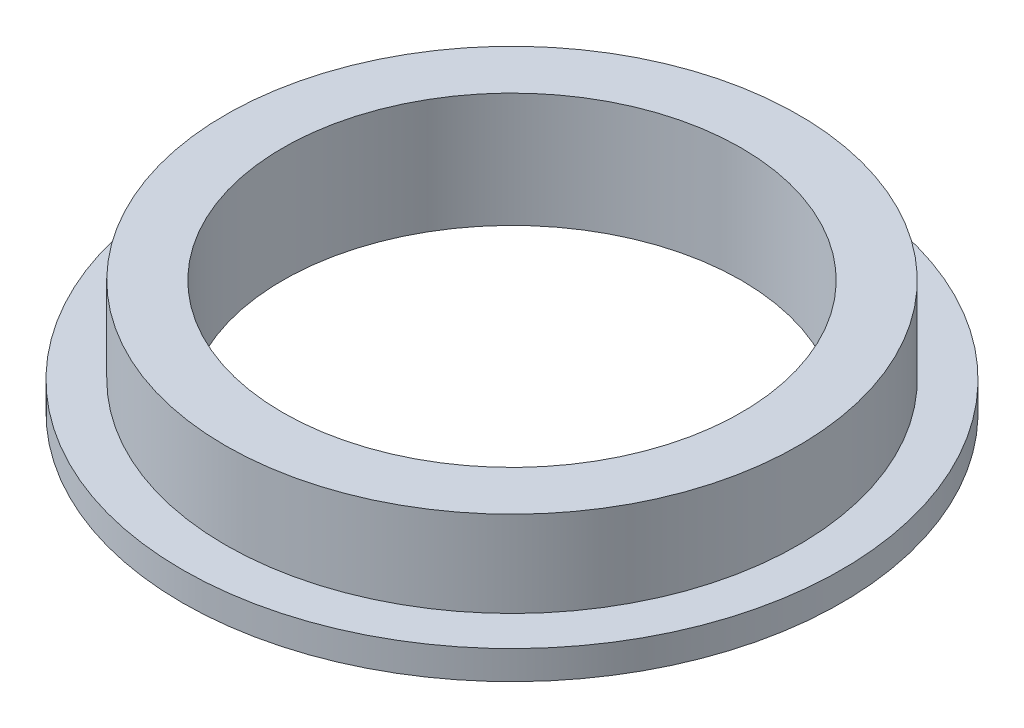
ISO-10303-21;
HEADER;
FILE_DESCRIPTION(('STEP AP214'),'2;1');
FILE_NAME('part.step','',(''),(''),'','','');
FILE_SCHEMA(('AUTOMOTIVE_DESIGN { 1 0 10303 214 1 1 1 1 }'));
ENDSEC;
DATA;
#1=APPLICATION_CONTEXT('core data for automotive mechanical design processes');
#2=APPLICATION_PROTOCOL_DEFINITION('international standard','automotive_design',2000,#1);
#3=PRODUCT_CONTEXT('',#1,'mechanical');
#4=PRODUCT('Part','Part','',(#3));
#5=PRODUCT_RELATED_PRODUCT_CATEGORY('part','',(#4));
#6=PRODUCT_DEFINITION_FORMATION('','',#4);
#7=PRODUCT_DEFINITION_CONTEXT('part definition',#1,'design');
#8=PRODUCT_DEFINITION('design','',#6,#7);
#9=PRODUCT_DEFINITION_SHAPE('','',#8);
#10=(LENGTH_UNIT() NAMED_UNIT(*) SI_UNIT(.MILLI.,.METRE.));
#11=(NAMED_UNIT(*) PLANE_ANGLE_UNIT() SI_UNIT($,.RADIAN.));
#12=(NAMED_UNIT(*) SI_UNIT($,.STERADIAN.) SOLID_ANGLE_UNIT());
#13=UNCERTAINTY_MEASURE_WITH_UNIT(LENGTH_MEASURE(1.E-05),#10,'distance_accuracy_value','');
#14=(GEOMETRIC_REPRESENTATION_CONTEXT(3) GLOBAL_UNCERTAINTY_ASSIGNED_CONTEXT((#13)) GLOBAL_UNIT_ASSIGNED_CONTEXT((#10,
#11,#12)) REPRESENTATION_CONTEXT('',''));
#15=CARTESIAN_POINT('',(0.,0.,0.));
#16=DIRECTION('',(0.,0.,1.));
#17=DIRECTION('',(1.,0.,0.));
#18=AXIS2_PLACEMENT_3D('',#15,#16,#17);
#19=CARTESIAN_POINT('',(0.,25.4,0.));
#20=DIRECTION('',(0.,-1.,0.));
#21=DIRECTION('',(0.,0.,-1.));
#22=AXIS2_PLACEMENT_3D('',#19,#20,#21);
#23=CYLINDRICAL_SURFACE('',#22,15.875);
#24=CARTESIAN_POINT('',(0.,1.5875,0.));
#25=DIRECTION('',(0.,1.,0.));
#26=DIRECTION('',(0.,0.,1.));
#27=AXIS2_PLACEMENT_3D('',#24,#25,#26);
#28=CIRCLE('',#27,15.875);
#29=CARTESIAN_POINT('',(0.,1.5875,15.875));
#30=VERTEX_POINT('',#29);
#31=EDGE_CURVE('E58',#30,#30,#28,.T.);
#32=ORIENTED_EDGE('',*,*,#31,.T.);
#33=EDGE_LOOP('',(#32));
#34=FACE_BOUND('',#33,.T.);
#35=CARTESIAN_POINT('',(0.,6.35,0.));
#36=DIRECTION('',(0.,1.,0.));
#37=DIRECTION('',(0.,0.,1.));
#38=AXIS2_PLACEMENT_3D('',#35,#36,#37);
#39=CIRCLE('',#38,15.875);
#40=CARTESIAN_POINT('',(0.,6.35,15.875));
#41=VERTEX_POINT('',#40);
#42=EDGE_CURVE('E63',#41,#41,#39,.T.);
#43=ORIENTED_EDGE('',*,*,#42,.F.);
#44=EDGE_LOOP('',(#43));
#45=FACE_BOUND('',#44,.T.);
#46=ADVANCED_FACE('F40',(#34,#45),#23,.T.);
#47=CARTESIAN_POINT('',(0.,25.4,0.));
#48=DIRECTION('',(0.,-1.,0.));
#49=DIRECTION('',(0.,0.,-1.));
#50=AXIS2_PLACEMENT_3D('',#47,#48,#49);
#51=CYLINDRICAL_SURFACE('',#50,12.7);
#52=CARTESIAN_POINT('',(0.,0.,0.));
#53=DIRECTION('',(0.,1.,0.));
#54=DIRECTION('',(0.,0.,1.));
#55=AXIS2_PLACEMENT_3D('',#52,#53,#54);
#56=CIRCLE('',#55,12.7);
#57=CARTESIAN_POINT('',(0.,0.,12.7));
#58=VERTEX_POINT('',#57);
#59=EDGE_CURVE('E12',#58,#58,#56,.T.);
#60=ORIENTED_EDGE('',*,*,#59,.F.);
#61=EDGE_LOOP('',(#60));
#62=FACE_BOUND('',#61,.T.);
#63=CARTESIAN_POINT('',(0.,6.35,0.));
#64=DIRECTION('',(0.,1.,0.));
#65=DIRECTION('',(0.,0.,1.));
#66=AXIS2_PLACEMENT_3D('',#63,#64,#65);
#67=CIRCLE('',#66,12.7);
#68=CARTESIAN_POINT('',(0.,6.35,12.7));
#69=VERTEX_POINT('',#68);
#70=EDGE_CURVE('E43',#69,#69,#67,.T.);
#71=ORIENTED_EDGE('',*,*,#70,.T.);
#72=EDGE_LOOP('',(#71));
#73=FACE_BOUND('',#72,.T.);
#74=ADVANCED_FACE('F72',(#62,#73),#51,.F.);
#75=CARTESIAN_POINT('',(0.,0.,0.));
#76=DIRECTION('',(0.,1.,0.));
#77=DIRECTION('',(0.,0.,1.));
#78=AXIS2_PLACEMENT_3D('',#75,#76,#77);
#79=PLANE('',#78);
#80=ORIENTED_EDGE('',*,*,#59,.T.);
#81=EDGE_LOOP('',(#80));
#82=FACE_BOUND('',#81,.T.);
#83=CARTESIAN_POINT('',(0.,0.,0.));
#84=DIRECTION('',(0.,1.,0.));
#85=DIRECTION('',(0.,0.,1.));
#86=AXIS2_PLACEMENT_3D('',#83,#84,#85);
#87=CIRCLE('',#86,18.25625);
#88=CARTESIAN_POINT('',(0.,0.,18.25625));
#89=VERTEX_POINT('',#88);
#90=EDGE_CURVE('E53',#89,#89,#87,.T.);
#91=ORIENTED_EDGE('',*,*,#90,.F.);
#92=EDGE_LOOP('',(#91));
#93=FACE_BOUND('',#92,.T.);
#94=ADVANCED_FACE('F92',(#82,#93),#79,.F.);
#95=CARTESIAN_POINT('',(0.,1.5875,0.));
#96=DIRECTION('',(0.,1.,0.));
#97=DIRECTION('',(0.,0.,1.));
#98=AXIS2_PLACEMENT_3D('',#95,#96,#97);
#99=PLANE('',#98);
#100=CARTESIAN_POINT('',(0.,1.5875,0.));
#101=DIRECTION('',(0.,1.,0.));
#102=DIRECTION('',(0.,0.,1.));
#103=AXIS2_PLACEMENT_3D('',#100,#101,#102);
#104=CIRCLE('',#103,18.25625);
#105=CARTESIAN_POINT('',(0.,1.5875,18.25625));
#106=VERTEX_POINT('',#105);
#107=EDGE_CURVE('E48',#106,#106,#104,.T.);
#108=ORIENTED_EDGE('',*,*,#107,.T.);
#109=EDGE_LOOP('',(#108));
#110=FACE_BOUND('',#109,.T.);
#111=ORIENTED_EDGE('',*,*,#31,.F.);
#112=EDGE_LOOP('',(#111));
#113=FACE_BOUND('',#112,.T.);
#114=ADVANCED_FACE('F82',(#110,#113),#99,.T.);
#115=CARTESIAN_POINT('',(0.,1.5875,0.));
#116=DIRECTION('',(0.,-1.,0.));
#117=DIRECTION('',(0.,0.,-1.));
#118=AXIS2_PLACEMENT_3D('',#115,#116,#117);
#119=CYLINDRICAL_SURFACE('',#118,18.25625);
#120=ORIENTED_EDGE('',*,*,#107,.F.);
#121=EDGE_LOOP('',(#120));
#122=FACE_BOUND('',#121,.T.);
#123=ORIENTED_EDGE('',*,*,#90,.T.);
#124=EDGE_LOOP('',(#123));
#125=FACE_BOUND('',#124,.T.);
#126=ADVANCED_FACE('F76',(#122,#125),#119,.T.);
#127=CARTESIAN_POINT('',(0.,6.35,0.));
#128=DIRECTION('',(0.,1.,0.));
#129=DIRECTION('',(0.,0.,1.));
#130=AXIS2_PLACEMENT_3D('',#127,#128,#129);
#131=PLANE('',#130);
#132=ORIENTED_EDGE('',*,*,#70,.F.);
#133=EDGE_LOOP('',(#132));
#134=FACE_BOUND('',#133,.T.);
#135=ORIENTED_EDGE('',*,*,#42,.T.);
#136=EDGE_LOOP('',(#135));
#137=FACE_BOUND('',#136,.T.);
#138=ADVANCED_FACE('F74',(#134,#137),#131,.T.);
#139=CLOSED_SHELL('',(#46,#74,#94,#114,#126,#138));
#140=MANIFOLD_SOLID_BREP('B2',#139);
#141=ADVANCED_BREP_SHAPE_REPRESENTATION('',(#18,#140),#14);
#142=SHAPE_DEFINITION_REPRESENTATION(#9,#141);
ENDSEC;
END-ISO-10303-21;
